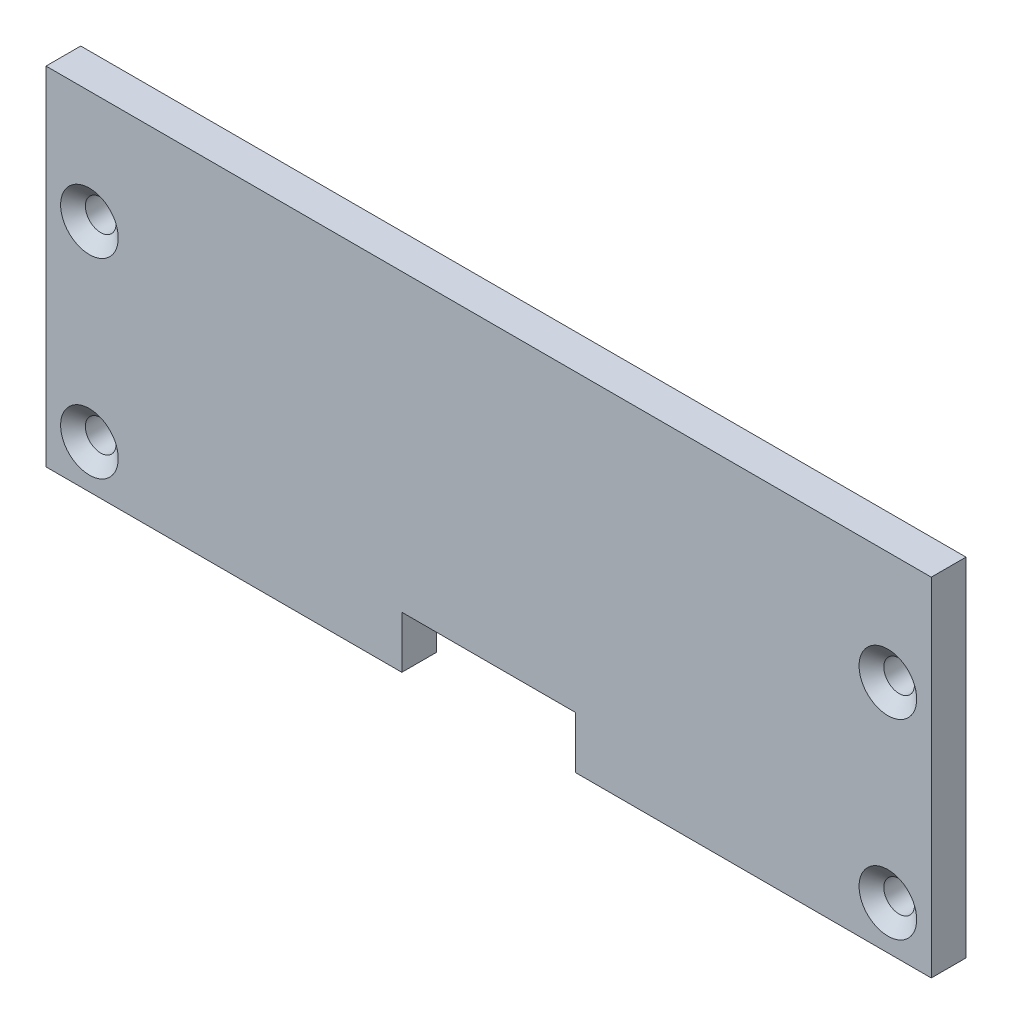
ISO-10303-21;
HEADER;
FILE_DESCRIPTION(('STEP AP214'),'2;1');
FILE_NAME('part.step','',(''),(''),'','','');
FILE_SCHEMA(('AUTOMOTIVE_DESIGN { 1 0 10303 214 1 1 1 1 }'));
ENDSEC;
DATA;
#1=APPLICATION_CONTEXT('core data for automotive mechanical design processes');
#2=APPLICATION_PROTOCOL_DEFINITION('international standard','automotive_design',2000,#1);
#3=PRODUCT_CONTEXT('',#1,'mechanical');
#4=PRODUCT('Part','Part','',(#3));
#5=PRODUCT_RELATED_PRODUCT_CATEGORY('part','',(#4));
#6=PRODUCT_DEFINITION_FORMATION('','',#4);
#7=PRODUCT_DEFINITION_CONTEXT('part definition',#1,'design');
#8=PRODUCT_DEFINITION('design','',#6,#7);
#9=PRODUCT_DEFINITION_SHAPE('','',#8);
#10=(LENGTH_UNIT() NAMED_UNIT(*) SI_UNIT(.MILLI.,.METRE.));
#11=(NAMED_UNIT(*) PLANE_ANGLE_UNIT() SI_UNIT($,.RADIAN.));
#12=(NAMED_UNIT(*) SI_UNIT($,.STERADIAN.) SOLID_ANGLE_UNIT());
#13=UNCERTAINTY_MEASURE_WITH_UNIT(LENGTH_MEASURE(1.E-05),#10,'distance_accuracy_value','');
#14=(GEOMETRIC_REPRESENTATION_CONTEXT(3) GLOBAL_UNCERTAINTY_ASSIGNED_CONTEXT((#13)) GLOBAL_UNIT_ASSIGNED_CONTEXT((#10,
#11,#12)) REPRESENTATION_CONTEXT('',''));
#15=CARTESIAN_POINT('',(0.,0.,0.));
#16=DIRECTION('',(0.,0.,1.));
#17=DIRECTION('',(1.,0.,0.));
#18=AXIS2_PLACEMENT_3D('',#15,#16,#17);
#19=CARTESIAN_POINT('',(-64.77,-25.4,5.08));
#20=DIRECTION('',(0.,1.,0.));
#21=DIRECTION('',(0.,0.,1.));
#22=AXIS2_PLACEMENT_3D('',#19,#20,#21);
#23=PLANE('',#22);
#24=DIRECTION('',(1.,0.,0.));
#25=VECTOR('',#24,1.);
#26=CARTESIAN_POINT('',(-64.77,-25.4,5.08));
#27=LINE('',#26,#25);
#28=CARTESIAN_POINT('',(12.7,-25.4,5.08));
#29=VERTEX_POINT('',#28);
#30=CARTESIAN_POINT('',(64.77,-25.4,5.08));
#31=VERTEX_POINT('',#30);
#32=EDGE_CURVE('E68',#29,#31,#27,.T.);
#33=ORIENTED_EDGE('',*,*,#32,.F.);
#34=DIRECTION('',(0.,0.,1.));
#35=VECTOR('',#34,1.);
#36=CARTESIAN_POINT('',(12.7,-25.4,0.));
#37=LINE('',#36,#35);
#38=CARTESIAN_POINT('',(12.7,-25.4,0.));
#39=VERTEX_POINT('',#38);
#40=EDGE_CURVE('E152',#39,#29,#37,.T.);
#41=ORIENTED_EDGE('',*,*,#40,.F.);
#42=DIRECTION('',(1.,0.,0.));
#43=VECTOR('',#42,1.);
#44=CARTESIAN_POINT('',(-64.77,-25.4,0.));
#45=LINE('',#44,#43);
#46=CARTESIAN_POINT('',(64.77,-25.4,0.));
#47=VERTEX_POINT('',#46);
#48=EDGE_CURVE('E90',#39,#47,#45,.T.);
#49=ORIENTED_EDGE('',*,*,#48,.T.);
#50=DIRECTION('',(0.,0.,-1.));
#51=VECTOR('',#50,1.);
#52=CARTESIAN_POINT('',(64.77,-25.4,5.08));
#53=LINE('',#52,#51);
#54=EDGE_CURVE('E223',#31,#47,#53,.T.);
#55=ORIENTED_EDGE('',*,*,#54,.F.);
#56=EDGE_LOOP('',(#33,#41,#49,#55));
#57=FACE_BOUND('',#56,.T.);
#58=ADVANCED_FACE('F43',(#57),#23,.F.);
#59=CARTESIAN_POINT('',(64.77,-25.4,5.08));
#60=DIRECTION('',(-1.,0.,0.));
#61=DIRECTION('',(0.,0.,1.));
#62=AXIS2_PLACEMENT_3D('',#59,#60,#61);
#63=PLANE('',#62);
#64=DIRECTION('',(0.,1.,0.));
#65=VECTOR('',#64,1.);
#66=CARTESIAN_POINT('',(64.77,-25.4,0.));
#67=LINE('',#66,#65);
#68=CARTESIAN_POINT('',(64.77,25.4,0.));
#69=VERTEX_POINT('',#68);
#70=EDGE_CURVE('E209',#47,#69,#67,.T.);
#71=ORIENTED_EDGE('',*,*,#70,.T.);
#72=DIRECTION('',(0.,0.,-1.));
#73=VECTOR('',#72,1.);
#74=CARTESIAN_POINT('',(64.77,25.4,5.08));
#75=LINE('',#74,#73);
#76=CARTESIAN_POINT('',(64.77,25.4,5.08));
#77=VERTEX_POINT('',#76);
#78=EDGE_CURVE('E11',#77,#69,#75,.T.);
#79=ORIENTED_EDGE('',*,*,#78,.F.);
#80=DIRECTION('',(0.,1.,0.));
#81=VECTOR('',#80,1.);
#82=CARTESIAN_POINT('',(64.77,-25.4,5.08));
#83=LINE('',#82,#81);
#84=EDGE_CURVE('E210',#31,#77,#83,.T.);
#85=ORIENTED_EDGE('',*,*,#84,.F.);
#86=ORIENTED_EDGE('',*,*,#54,.T.);
#87=EDGE_LOOP('',(#71,#79,#85,#86));
#88=FACE_BOUND('',#87,.T.);
#89=ADVANCED_FACE('F45',(#88),#63,.F.);
#90=CARTESIAN_POINT('',(-64.77,25.4,5.08));
#91=DIRECTION('',(0.,-1.,0.));
#92=DIRECTION('',(0.,0.,-1.));
#93=AXIS2_PLACEMENT_3D('',#90,#91,#92);
#94=PLANE('',#93);
#95=DIRECTION('',(-1.,0.,0.));
#96=VECTOR('',#95,1.);
#97=CARTESIAN_POINT('',(-64.77,25.4,0.));
#98=LINE('',#97,#96);
#99=CARTESIAN_POINT('',(-64.77,25.4,0.));
#100=VERTEX_POINT('',#99);
#101=EDGE_CURVE('E227',#69,#100,#98,.T.);
#102=ORIENTED_EDGE('',*,*,#101,.T.);
#103=DIRECTION('',(0.,0.,-1.));
#104=VECTOR('',#103,1.);
#105=CARTESIAN_POINT('',(-64.77,25.4,5.08));
#106=LINE('',#105,#104);
#107=CARTESIAN_POINT('',(-64.77,25.4,5.08));
#108=VERTEX_POINT('',#107);
#109=EDGE_CURVE('E52',#108,#100,#106,.T.);
#110=ORIENTED_EDGE('',*,*,#109,.F.);
#111=DIRECTION('',(-1.,0.,0.));
#112=VECTOR('',#111,1.);
#113=CARTESIAN_POINT('',(-64.77,25.4,5.08));
#114=LINE('',#113,#112);
#115=EDGE_CURVE('E97',#77,#108,#114,.T.);
#116=ORIENTED_EDGE('',*,*,#115,.F.);
#117=ORIENTED_EDGE('',*,*,#78,.T.);
#118=EDGE_LOOP('',(#102,#110,#116,#117));
#119=FACE_BOUND('',#118,.T.);
#120=ADVANCED_FACE('F257',(#119),#94,.F.);
#121=CARTESIAN_POINT('',(-64.77,-25.4,5.08));
#122=DIRECTION('',(1.,0.,0.));
#123=DIRECTION('',(0.,0.,-1.));
#124=AXIS2_PLACEMENT_3D('',#121,#122,#123);
#125=PLANE('',#124);
#126=DIRECTION('',(0.,-1.,0.));
#127=VECTOR('',#126,1.);
#128=CARTESIAN_POINT('',(-64.77,-25.4,0.));
#129=LINE('',#128,#127);
#130=CARTESIAN_POINT('',(-64.77,-25.4,0.));
#131=VERTEX_POINT('',#130);
#132=EDGE_CURVE('E230',#100,#131,#129,.T.);
#133=ORIENTED_EDGE('',*,*,#132,.T.);
#134=DIRECTION('',(0.,0.,-1.));
#135=VECTOR('',#134,1.);
#136=CARTESIAN_POINT('',(-64.77,-25.4,5.08));
#137=LINE('',#136,#135);
#138=CARTESIAN_POINT('',(-64.77,-25.4,5.08));
#139=VERTEX_POINT('',#138);
#140=EDGE_CURVE('E238',#139,#131,#137,.T.);
#141=ORIENTED_EDGE('',*,*,#140,.F.);
#142=DIRECTION('',(0.,-1.,0.));
#143=VECTOR('',#142,1.);
#144=CARTESIAN_POINT('',(-64.77,-25.4,5.08));
#145=LINE('',#144,#143);
#146=EDGE_CURVE('E216',#108,#139,#145,.T.);
#147=ORIENTED_EDGE('',*,*,#146,.F.);
#148=ORIENTED_EDGE('',*,*,#109,.T.);
#149=EDGE_LOOP('',(#133,#141,#147,#148));
#150=FACE_BOUND('',#149,.T.);
#151=ADVANCED_FACE('F246',(#150),#125,.F.);
#152=CARTESIAN_POINT('',(-12.7,-25.4,0.));
#153=VERTEX_POINT('',#152);
#154=EDGE_CURVE('E213',#131,#153,#45,.T.);
#155=ORIENTED_EDGE('',*,*,#154,.T.);
#156=DIRECTION('',(0.,0.,1.));
#157=VECTOR('',#156,1.);
#158=CARTESIAN_POINT('',(-12.7,-25.4,0.));
#159=LINE('',#158,#157);
#160=CARTESIAN_POINT('',(-12.7,-25.4,5.08));
#161=VERTEX_POINT('',#160);
#162=EDGE_CURVE('E156',#153,#161,#159,.T.);
#163=ORIENTED_EDGE('',*,*,#162,.T.);
#164=EDGE_CURVE('E219',#139,#161,#27,.T.);
#165=ORIENTED_EDGE('',*,*,#164,.F.);
#166=ORIENTED_EDGE('',*,*,#140,.T.);
#167=EDGE_LOOP('',(#155,#163,#165,#166));
#168=FACE_BOUND('',#167,.T.);
#169=ADVANCED_FACE('F250',(#168),#23,.F.);
#170=CARTESIAN_POINT('',(0.,0.,5.08));
#171=DIRECTION('',(0.,0.,-1.));
#172=DIRECTION('',(-1.,0.,0.));
#173=AXIS2_PLACEMENT_3D('',#170,#171,#172);
#174=PLANE('',#173);
#175=CARTESIAN_POINT('',(-58.42,8.89,5.08));
#176=DIRECTION('',(0.,0.,1.));
#177=DIRECTION('',(1.,0.,0.));
#178=AXIS2_PLACEMENT_3D('',#175,#176,#177);
#179=CIRCLE('',#178,4.2164);
#180=CARTESIAN_POINT('',(-54.2036,8.89,5.08));
#181=VERTEX_POINT('',#180);
#182=EDGE_CURVE('E155',#181,#181,#179,.T.);
#183=ORIENTED_EDGE('',*,*,#182,.F.);
#184=EDGE_LOOP('',(#183));
#185=FACE_BOUND('',#184,.T.);
#186=CARTESIAN_POINT('',(-58.42,-19.05,5.08));
#187=DIRECTION('',(0.,0.,1.));
#188=DIRECTION('',(1.,0.,0.));
#189=AXIS2_PLACEMENT_3D('',#186,#187,#188);
#190=CIRCLE('',#189,4.2164);
#191=CARTESIAN_POINT('',(-54.2036,-19.05,5.08));
#192=VERTEX_POINT('',#191);
#193=EDGE_CURVE('E173',#192,#192,#190,.T.);
#194=ORIENTED_EDGE('',*,*,#193,.F.);
#195=EDGE_LOOP('',(#194));
#196=FACE_BOUND('',#195,.T.);
#197=CARTESIAN_POINT('',(58.42,-19.05,5.08));
#198=DIRECTION('',(0.,0.,1.));
#199=DIRECTION('',(1.,0.,0.));
#200=AXIS2_PLACEMENT_3D('',#197,#198,#199);
#201=CIRCLE('',#200,4.21639999999999);
#202=CARTESIAN_POINT('',(62.6364,-19.05,5.08));
#203=VERTEX_POINT('',#202);
#204=EDGE_CURVE('E185',#203,#203,#201,.T.);
#205=ORIENTED_EDGE('',*,*,#204,.F.);
#206=EDGE_LOOP('',(#205));
#207=FACE_BOUND('',#206,.T.);
#208=CARTESIAN_POINT('',(58.42,8.89,5.08));
#209=DIRECTION('',(0.,0.,1.));
#210=DIRECTION('',(1.,0.,0.));
#211=AXIS2_PLACEMENT_3D('',#208,#209,#210);
#212=CIRCLE('',#211,4.21639999999999);
#213=CARTESIAN_POINT('',(62.6364,8.89,5.08));
#214=VERTEX_POINT('',#213);
#215=EDGE_CURVE('E197',#214,#214,#212,.T.);
#216=ORIENTED_EDGE('',*,*,#215,.F.);
#217=EDGE_LOOP('',(#216));
#218=FACE_BOUND('',#217,.T.);
#219=DIRECTION('',(-1.,0.,0.));
#220=VECTOR('',#219,1.);
#221=CARTESIAN_POINT('',(-12.7,-17.78,5.08));
#222=LINE('',#221,#220);
#223=CARTESIAN_POINT('',(12.7,-17.78,5.08));
#224=VERTEX_POINT('',#223);
#225=CARTESIAN_POINT('',(-12.7,-17.78,5.08));
#226=VERTEX_POINT('',#225);
#227=EDGE_CURVE('E143',#224,#226,#222,.T.);
#228=ORIENTED_EDGE('',*,*,#227,.F.);
#229=DIRECTION('',(0.,1.,0.));
#230=VECTOR('',#229,1.);
#231=CARTESIAN_POINT('',(12.7,-25.4,5.08));
#232=LINE('',#231,#230);
#233=EDGE_CURVE('E123',#29,#224,#232,.T.);
#234=ORIENTED_EDGE('',*,*,#233,.F.);
#235=ORIENTED_EDGE('',*,*,#32,.T.);
#236=ORIENTED_EDGE('',*,*,#84,.T.);
#237=ORIENTED_EDGE('',*,*,#115,.T.);
#238=ORIENTED_EDGE('',*,*,#146,.T.);
#239=ORIENTED_EDGE('',*,*,#164,.T.);
#240=DIRECTION('',(0.,-1.,0.));
#241=VECTOR('',#240,1.);
#242=CARTESIAN_POINT('',(-12.7,-25.4,5.08));
#243=LINE('',#242,#241);
#244=EDGE_CURVE('E140',#226,#161,#243,.T.);
#245=ORIENTED_EDGE('',*,*,#244,.F.);
#246=EDGE_LOOP('',(#228,#234,#235,#236,#237,#238,#239,#245));
#247=FACE_BOUND('',#246,.T.);
#248=ADVANCED_FACE('F253',(#185,#196,#207,#218,#247),#174,.F.);
#249=CARTESIAN_POINT('',(0.,0.,0.));
#250=DIRECTION('',(0.,0.,-1.));
#251=DIRECTION('',(-1.,0.,0.));
#252=AXIS2_PLACEMENT_3D('',#249,#250,#251);
#253=PLANE('',#252);
#254=DIRECTION('',(0.,1.,0.));
#255=VECTOR('',#254,1.);
#256=CARTESIAN_POINT('',(12.7,-25.4,0.));
#257=LINE('',#256,#255);
#258=CARTESIAN_POINT('',(12.7,-17.78,0.));
#259=VERTEX_POINT('',#258);
#260=EDGE_CURVE('E122',#39,#259,#257,.T.);
#261=ORIENTED_EDGE('',*,*,#260,.T.);
#262=DIRECTION('',(-1.,0.,0.));
#263=VECTOR('',#262,1.);
#264=CARTESIAN_POINT('',(-12.7,-17.78,0.));
#265=LINE('',#264,#263);
#266=CARTESIAN_POINT('',(-12.7,-17.78,0.));
#267=VERTEX_POINT('',#266);
#268=EDGE_CURVE('E131',#259,#267,#265,.T.);
#269=ORIENTED_EDGE('',*,*,#268,.T.);
#270=DIRECTION('',(0.,-1.,0.));
#271=VECTOR('',#270,1.);
#272=CARTESIAN_POINT('',(-12.7,-25.4,0.));
#273=LINE('',#272,#271);
#274=EDGE_CURVE('E59',#267,#153,#273,.T.);
#275=ORIENTED_EDGE('',*,*,#274,.T.);
#276=ORIENTED_EDGE('',*,*,#154,.F.);
#277=ORIENTED_EDGE('',*,*,#132,.F.);
#278=ORIENTED_EDGE('',*,*,#101,.F.);
#279=ORIENTED_EDGE('',*,*,#70,.F.);
#280=ORIENTED_EDGE('',*,*,#48,.F.);
#281=EDGE_LOOP('',(#261,#269,#275,#276,#277,#278,#279,#280));
#282=FACE_BOUND('',#281,.T.);
#283=CARTESIAN_POINT('',(-58.42,8.89,0.));
#284=DIRECTION('',(0.,0.,1.));
#285=DIRECTION('',(1.,0.,0.));
#286=AXIS2_PLACEMENT_3D('',#283,#284,#285);
#287=CIRCLE('',#286,2.2479);
#288=CARTESIAN_POINT('',(-56.1721,8.89,0.));
#289=VERTEX_POINT('',#288);
#290=EDGE_CURVE('E169',#289,#289,#287,.T.);
#291=ORIENTED_EDGE('',*,*,#290,.T.);
#292=EDGE_LOOP('',(#291));
#293=FACE_BOUND('',#292,.T.);
#294=CARTESIAN_POINT('',(-58.42,-19.05,0.));
#295=DIRECTION('',(0.,0.,1.));
#296=DIRECTION('',(1.,0.,0.));
#297=AXIS2_PLACEMENT_3D('',#294,#295,#296);
#298=CIRCLE('',#297,2.2479);
#299=CARTESIAN_POINT('',(-56.1721,-19.05,0.));
#300=VERTEX_POINT('',#299);
#301=EDGE_CURVE('E181',#300,#300,#298,.T.);
#302=ORIENTED_EDGE('',*,*,#301,.T.);
#303=EDGE_LOOP('',(#302));
#304=FACE_BOUND('',#303,.T.);
#305=CARTESIAN_POINT('',(58.42,-19.05,0.));
#306=DIRECTION('',(0.,0.,1.));
#307=DIRECTION('',(1.,0.,0.));
#308=AXIS2_PLACEMENT_3D('',#305,#306,#307);
#309=CIRCLE('',#308,2.2479);
#310=CARTESIAN_POINT('',(60.6679,-19.05,0.));
#311=VERTEX_POINT('',#310);
#312=EDGE_CURVE('E193',#311,#311,#309,.T.);
#313=ORIENTED_EDGE('',*,*,#312,.T.);
#314=EDGE_LOOP('',(#313));
#315=FACE_BOUND('',#314,.T.);
#316=CARTESIAN_POINT('',(58.42,8.89,0.));
#317=DIRECTION('',(0.,0.,1.));
#318=DIRECTION('',(1.,0.,0.));
#319=AXIS2_PLACEMENT_3D('',#316,#317,#318);
#320=CIRCLE('',#319,2.2479);
#321=CARTESIAN_POINT('',(60.6679,8.89,0.));
#322=VERTEX_POINT('',#321);
#323=EDGE_CURVE('E205',#322,#322,#320,.T.);
#324=ORIENTED_EDGE('',*,*,#323,.T.);
#325=EDGE_LOOP('',(#324));
#326=FACE_BOUND('',#325,.T.);
#327=ADVANCED_FACE('F136',(#282,#293,#304,#315,#326),#253,.T.);
#328=CARTESIAN_POINT('',(58.42,8.89,5.08));
#329=DIRECTION('',(0.,0.,1.));
#330=DIRECTION('',(1.,0.,0.));
#331=AXIS2_PLACEMENT_3D('',#328,#329,#330);
#332=CYLINDRICAL_SURFACE('',#331,2.2479);
#333=ORIENTED_EDGE('',*,*,#323,.F.);
#334=EDGE_LOOP('',(#333));
#335=FACE_BOUND('',#334,.T.);
#336=CARTESIAN_POINT('',(58.42,8.89,3.42823237602752));
#337=DIRECTION('',(0.,0.,1.));
#338=DIRECTION('',(1.,0.,0.));
#339=AXIS2_PLACEMENT_3D('',#336,#337,#338);
#340=CIRCLE('',#339,2.2479);
#341=CARTESIAN_POINT('',(60.6679,8.89,3.42823237602752));
#342=VERTEX_POINT('',#341);
#343=EDGE_CURVE('E201',#342,#342,#340,.T.);
#344=ORIENTED_EDGE('',*,*,#343,.T.);
#345=EDGE_LOOP('',(#344));
#346=FACE_BOUND('',#345,.T.);
#347=ADVANCED_FACE('F278',(#335,#346),#332,.F.);
#348=CARTESIAN_POINT('',(58.42,8.89,5.08));
#349=DIRECTION('',(0.,0.,1.));
#350=DIRECTION('',(1.,0.,0.));
#351=AXIS2_PLACEMENT_3D('',#348,#349,#350);
#352=CONICAL_SURFACE('',#351,4.21639999999999,0.872664625997163);
#353=ORIENTED_EDGE('',*,*,#343,.F.);
#354=EDGE_LOOP('',(#353));
#355=FACE_BOUND('',#354,.T.);
#356=ORIENTED_EDGE('',*,*,#215,.T.);
#357=EDGE_LOOP('',(#356));
#358=FACE_BOUND('',#357,.T.);
#359=ADVANCED_FACE('F284',(#355,#358),#352,.F.);
#360=CARTESIAN_POINT('',(58.42,-19.05,5.08));
#361=DIRECTION('',(0.,0.,1.));
#362=DIRECTION('',(1.,0.,0.));
#363=AXIS2_PLACEMENT_3D('',#360,#361,#362);
#364=CYLINDRICAL_SURFACE('',#363,2.2479);
#365=ORIENTED_EDGE('',*,*,#312,.F.);
#366=EDGE_LOOP('',(#365));
#367=FACE_BOUND('',#366,.T.);
#368=CARTESIAN_POINT('',(58.42,-19.05,3.42823237602752));
#369=DIRECTION('',(0.,0.,1.));
#370=DIRECTION('',(1.,0.,0.));
#371=AXIS2_PLACEMENT_3D('',#368,#369,#370);
#372=CIRCLE('',#371,2.2479);
#373=CARTESIAN_POINT('',(60.6679,-19.05,3.42823237602752));
#374=VERTEX_POINT('',#373);
#375=EDGE_CURVE('E189',#374,#374,#372,.T.);
#376=ORIENTED_EDGE('',*,*,#375,.T.);
#377=EDGE_LOOP('',(#376));
#378=FACE_BOUND('',#377,.T.);
#379=ADVANCED_FACE('F288',(#367,#378),#364,.F.);
#380=CARTESIAN_POINT('',(58.42,-19.05,5.08));
#381=DIRECTION('',(0.,0.,1.));
#382=DIRECTION('',(1.,0.,0.));
#383=AXIS2_PLACEMENT_3D('',#380,#381,#382);
#384=CONICAL_SURFACE('',#383,4.21639999999999,0.872664625997163);
#385=ORIENTED_EDGE('',*,*,#375,.F.);
#386=EDGE_LOOP('',(#385));
#387=FACE_BOUND('',#386,.T.);
#388=ORIENTED_EDGE('',*,*,#204,.T.);
#389=EDGE_LOOP('',(#388));
#390=FACE_BOUND('',#389,.T.);
#391=ADVANCED_FACE('F292',(#387,#390),#384,.F.);
#392=CARTESIAN_POINT('',(-58.42,-19.05,5.08));
#393=DIRECTION('',(0.,0.,1.));
#394=DIRECTION('',(1.,0.,0.));
#395=AXIS2_PLACEMENT_3D('',#392,#393,#394);
#396=CYLINDRICAL_SURFACE('',#395,2.2479);
#397=ORIENTED_EDGE('',*,*,#301,.F.);
#398=EDGE_LOOP('',(#397));
#399=FACE_BOUND('',#398,.T.);
#400=CARTESIAN_POINT('',(-58.42,-19.05,3.42823237602752));
#401=DIRECTION('',(0.,0.,1.));
#402=DIRECTION('',(1.,0.,0.));
#403=AXIS2_PLACEMENT_3D('',#400,#401,#402);
#404=CIRCLE('',#403,2.2479);
#405=CARTESIAN_POINT('',(-56.1721,-19.05,3.42823237602752));
#406=VERTEX_POINT('',#405);
#407=EDGE_CURVE('E177',#406,#406,#404,.T.);
#408=ORIENTED_EDGE('',*,*,#407,.T.);
#409=EDGE_LOOP('',(#408));
#410=FACE_BOUND('',#409,.T.);
#411=ADVANCED_FACE('F296',(#399,#410),#396,.F.);
#412=CARTESIAN_POINT('',(-58.42,-19.05,5.08));
#413=DIRECTION('',(0.,0.,1.));
#414=DIRECTION('',(1.,0.,0.));
#415=AXIS2_PLACEMENT_3D('',#412,#413,#414);
#416=CONICAL_SURFACE('',#415,4.2164,0.872664625997165);
#417=ORIENTED_EDGE('',*,*,#407,.F.);
#418=EDGE_LOOP('',(#417));
#419=FACE_BOUND('',#418,.T.);
#420=ORIENTED_EDGE('',*,*,#193,.T.);
#421=EDGE_LOOP('',(#420));
#422=FACE_BOUND('',#421,.T.);
#423=ADVANCED_FACE('F300',(#419,#422),#416,.F.);
#424=CARTESIAN_POINT('',(-58.42,8.89,5.08));
#425=DIRECTION('',(0.,0.,1.));
#426=DIRECTION('',(1.,0.,0.));
#427=AXIS2_PLACEMENT_3D('',#424,#425,#426);
#428=CYLINDRICAL_SURFACE('',#427,2.2479);
#429=ORIENTED_EDGE('',*,*,#290,.F.);
#430=EDGE_LOOP('',(#429));
#431=FACE_BOUND('',#430,.T.);
#432=CARTESIAN_POINT('',(-58.42,8.89,3.42823237602752));
#433=DIRECTION('',(0.,0.,1.));
#434=DIRECTION('',(1.,0.,0.));
#435=AXIS2_PLACEMENT_3D('',#432,#433,#434);
#436=CIRCLE('',#435,2.2479);
#437=CARTESIAN_POINT('',(-56.1721,8.89,3.42823237602752));
#438=VERTEX_POINT('',#437);
#439=EDGE_CURVE('E165',#438,#438,#436,.T.);
#440=ORIENTED_EDGE('',*,*,#439,.T.);
#441=EDGE_LOOP('',(#440));
#442=FACE_BOUND('',#441,.T.);
#443=ADVANCED_FACE('F304',(#431,#442),#428,.F.);
#444=CARTESIAN_POINT('',(-58.42,8.89,5.08));
#445=DIRECTION('',(0.,0.,1.));
#446=DIRECTION('',(1.,0.,0.));
#447=AXIS2_PLACEMENT_3D('',#444,#445,#446);
#448=CONICAL_SURFACE('',#447,4.2164,0.872664625997165);
#449=ORIENTED_EDGE('',*,*,#439,.F.);
#450=EDGE_LOOP('',(#449));
#451=FACE_BOUND('',#450,.T.);
#452=ORIENTED_EDGE('',*,*,#182,.T.);
#453=EDGE_LOOP('',(#452));
#454=FACE_BOUND('',#453,.T.);
#455=ADVANCED_FACE('F308',(#451,#454),#448,.F.);
#456=CARTESIAN_POINT('',(12.7,-25.4,0.));
#457=DIRECTION('',(1.,0.,0.));
#458=DIRECTION('',(0.,0.,-1.));
#459=AXIS2_PLACEMENT_3D('',#456,#457,#458);
#460=PLANE('',#459);
#461=ORIENTED_EDGE('',*,*,#233,.T.);
#462=DIRECTION('',(0.,0.,1.));
#463=VECTOR('',#462,1.);
#464=CARTESIAN_POINT('',(12.7,-17.78,0.));
#465=LINE('',#464,#463);
#466=EDGE_CURVE('E118',#259,#224,#465,.T.);
#467=ORIENTED_EDGE('',*,*,#466,.F.);
#468=ORIENTED_EDGE('',*,*,#260,.F.);
#469=ORIENTED_EDGE('',*,*,#40,.T.);
#470=EDGE_LOOP('',(#461,#467,#468,#469));
#471=FACE_BOUND('',#470,.T.);
#472=ADVANCED_FACE('F120',(#471),#460,.F.);
#473=CARTESIAN_POINT('',(-12.7,-25.4,0.));
#474=DIRECTION('',(-1.,0.,0.));
#475=DIRECTION('',(0.,0.,1.));
#476=AXIS2_PLACEMENT_3D('',#473,#474,#475);
#477=PLANE('',#476);
#478=ORIENTED_EDGE('',*,*,#244,.T.);
#479=ORIENTED_EDGE('',*,*,#162,.F.);
#480=ORIENTED_EDGE('',*,*,#274,.F.);
#481=DIRECTION('',(0.,0.,1.));
#482=VECTOR('',#481,1.);
#483=CARTESIAN_POINT('',(-12.7,-17.78,0.));
#484=LINE('',#483,#482);
#485=EDGE_CURVE('E128',#267,#226,#484,.T.);
#486=ORIENTED_EDGE('',*,*,#485,.T.);
#487=EDGE_LOOP('',(#478,#479,#480,#486));
#488=FACE_BOUND('',#487,.T.);
#489=ADVANCED_FACE('F315',(#488),#477,.F.);
#490=CARTESIAN_POINT('',(-12.7,-17.78,0.));
#491=DIRECTION('',(0.,1.,0.));
#492=DIRECTION('',(0.,0.,1.));
#493=AXIS2_PLACEMENT_3D('',#490,#491,#492);
#494=PLANE('',#493);
#495=ORIENTED_EDGE('',*,*,#227,.T.);
#496=ORIENTED_EDGE('',*,*,#485,.F.);
#497=ORIENTED_EDGE('',*,*,#268,.F.);
#498=ORIENTED_EDGE('',*,*,#466,.T.);
#499=EDGE_LOOP('',(#495,#496,#497,#498));
#500=FACE_BOUND('',#499,.T.);
#501=ADVANCED_FACE('F132',(#500),#494,.F.);
#502=CLOSED_SHELL('',(#58,#89,#120,#151,#169,#248,#327,#347,#359,#379,#391,#411,#423,#443,#455,
#472,#489,#501));
#503=MANIFOLD_SOLID_BREP('B2',#502);
#504=ADVANCED_BREP_SHAPE_REPRESENTATION('',(#18,#503),#14);
#505=SHAPE_DEFINITION_REPRESENTATION(#9,#504);
ENDSEC;
END-ISO-10303-21;
